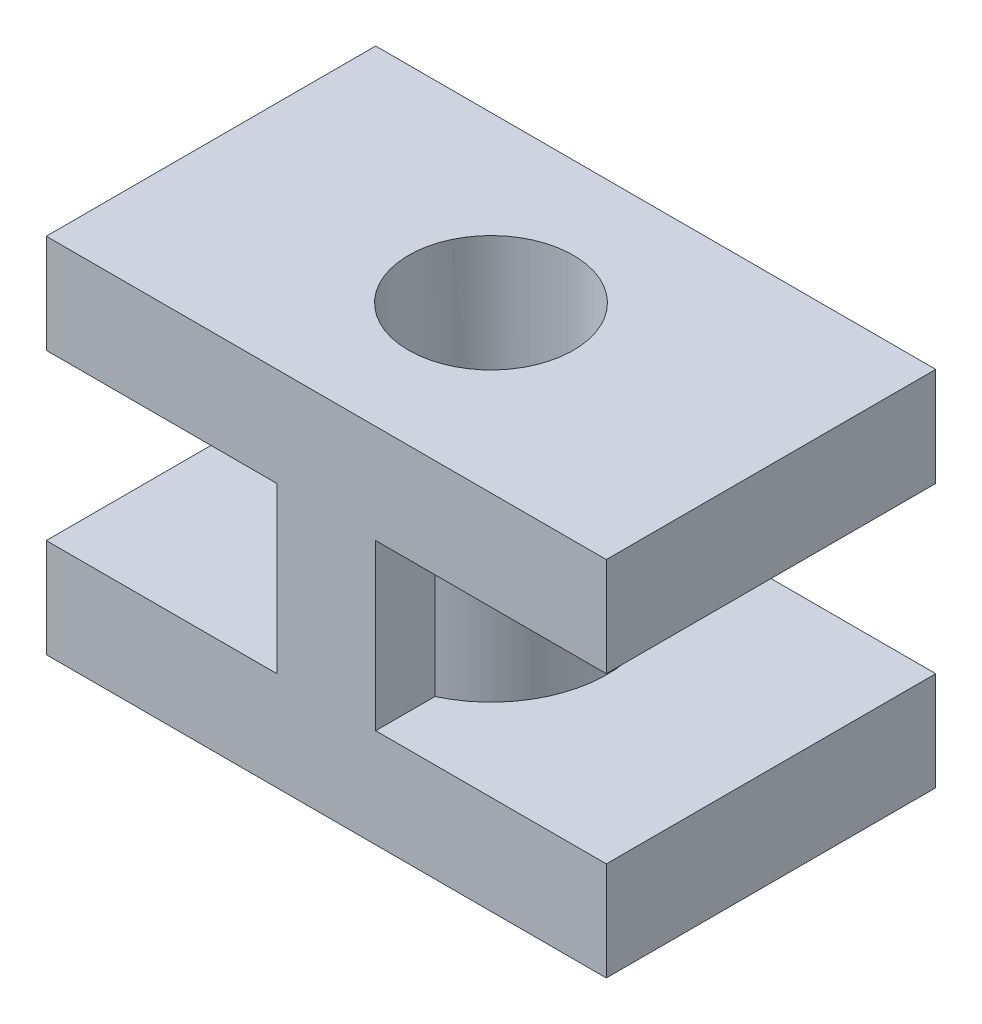
ISO-10303-21;
HEADER;
FILE_DESCRIPTION(('STEP AP214'),'2;1');
FILE_NAME('part.step','',(''),(''),'','','');
FILE_SCHEMA(('AUTOMOTIVE_DESIGN { 1 0 10303 214 1 1 1 1 }'));
ENDSEC;
DATA;
#1=APPLICATION_CONTEXT('core data for automotive mechanical design processes');
#2=APPLICATION_PROTOCOL_DEFINITION('international standard','automotive_design',2000,#1);
#3=PRODUCT_CONTEXT('',#1,'mechanical');
#4=PRODUCT('Part','Part','',(#3));
#5=PRODUCT_RELATED_PRODUCT_CATEGORY('part','',(#4));
#6=PRODUCT_DEFINITION_FORMATION('','',#4);
#7=PRODUCT_DEFINITION_CONTEXT('part definition',#1,'design');
#8=PRODUCT_DEFINITION('design','',#6,#7);
#9=PRODUCT_DEFINITION_SHAPE('','',#8);
#10=(LENGTH_UNIT() NAMED_UNIT(*) SI_UNIT(.MILLI.,.METRE.));
#11=(NAMED_UNIT(*) PLANE_ANGLE_UNIT() SI_UNIT($,.RADIAN.));
#12=(NAMED_UNIT(*) SI_UNIT($,.STERADIAN.) SOLID_ANGLE_UNIT());
#13=UNCERTAINTY_MEASURE_WITH_UNIT(LENGTH_MEASURE(1.E-05),#10,'distance_accuracy_value','');
#14=(GEOMETRIC_REPRESENTATION_CONTEXT(3) GLOBAL_UNCERTAINTY_ASSIGNED_CONTEXT((#13)) GLOBAL_UNIT_ASSIGNED_CONTEXT((#10,
#11,#12)) REPRESENTATION_CONTEXT('',''));
#15=CARTESIAN_POINT('',(0.,0.,0.));
#16=DIRECTION('',(0.,0.,1.));
#17=DIRECTION('',(1.,0.,0.));
#18=AXIS2_PLACEMENT_3D('',#15,#16,#17);
#19=CARTESIAN_POINT('',(4.25,1.5,2.5));
#20=DIRECTION('',(-1.,0.,0.));
#21=DIRECTION('',(0.,0.,1.));
#22=AXIS2_PLACEMENT_3D('',#19,#20,#21);
#23=PLANE('',#22);
#24=DIRECTION('',(0.,0.,-1.));
#25=VECTOR('',#24,1.);
#26=CARTESIAN_POINT('',(4.25,0.,2.5));
#27=LINE('',#26,#25);
#28=CARTESIAN_POINT('',(4.25,0.,2.5));
#29=VERTEX_POINT('',#28);
#30=CARTESIAN_POINT('',(4.25,0.,-2.5));
#31=VERTEX_POINT('',#30);
#32=EDGE_CURVE('E196',#29,#31,#27,.T.);
#33=ORIENTED_EDGE('',*,*,#32,.T.);
#34=DIRECTION('',(0.,-1.,0.));
#35=VECTOR('',#34,1.);
#36=CARTESIAN_POINT('',(4.25,1.5,-2.5));
#37=LINE('',#36,#35);
#38=CARTESIAN_POINT('',(4.25,1.5,-2.5));
#39=VERTEX_POINT('',#38);
#40=EDGE_CURVE('E11',#39,#31,#37,.T.);
#41=ORIENTED_EDGE('',*,*,#40,.F.);
#42=DIRECTION('',(0.,0.,-1.));
#43=VECTOR('',#42,1.);
#44=CARTESIAN_POINT('',(4.25,1.5,2.5));
#45=LINE('',#44,#43);
#46=CARTESIAN_POINT('',(4.25,1.5,2.5));
#47=VERTEX_POINT('',#46);
#48=EDGE_CURVE('E197',#47,#39,#45,.T.);
#49=ORIENTED_EDGE('',*,*,#48,.F.);
#50=DIRECTION('',(0.,-1.,0.));
#51=VECTOR('',#50,1.);
#52=CARTESIAN_POINT('',(4.25,1.5,2.5));
#53=LINE('',#52,#51);
#54=EDGE_CURVE('E212',#47,#29,#53,.T.);
#55=ORIENTED_EDGE('',*,*,#54,.T.);
#56=EDGE_LOOP('',(#33,#41,#49,#55));
#57=FACE_BOUND('',#56,.T.);
#58=ADVANCED_FACE('F39',(#57),#23,.F.);
#59=CARTESIAN_POINT('',(-4.25,1.5,-2.5));
#60=DIRECTION('',(0.,0.,1.));
#61=DIRECTION('',(1.,0.,0.));
#62=AXIS2_PLACEMENT_3D('',#59,#60,#61);
#63=PLANE('',#62);
#64=DIRECTION('',(-1.,0.,0.));
#65=VECTOR('',#64,1.);
#66=CARTESIAN_POINT('',(-4.25,0.,-2.5));
#67=LINE('',#66,#65);
#68=CARTESIAN_POINT('',(-4.25,0.,-2.5));
#69=VERTEX_POINT('',#68);
#70=EDGE_CURVE('E216',#31,#69,#67,.T.);
#71=ORIENTED_EDGE('',*,*,#70,.T.);
#72=DIRECTION('',(0.,-1.,0.));
#73=VECTOR('',#72,1.);
#74=CARTESIAN_POINT('',(-4.25,1.5,-2.5));
#75=LINE('',#74,#73);
#76=CARTESIAN_POINT('',(-4.25,1.5,-2.5));
#77=VERTEX_POINT('',#76);
#78=EDGE_CURVE('E47',#77,#69,#75,.T.);
#79=ORIENTED_EDGE('',*,*,#78,.F.);
#80=DIRECTION('',(-1.,0.,0.));
#81=VECTOR('',#80,1.);
#82=CARTESIAN_POINT('',(-4.25,1.5,-2.5));
#83=LINE('',#82,#81);
#84=EDGE_CURVE('E201',#39,#77,#83,.T.);
#85=ORIENTED_EDGE('',*,*,#84,.F.);
#86=ORIENTED_EDGE('',*,*,#40,.T.);
#87=EDGE_LOOP('',(#71,#79,#85,#86));
#88=FACE_BOUND('',#87,.T.);
#89=ADVANCED_FACE('F292',(#88),#63,.F.);
#90=CARTESIAN_POINT('',(-4.25,1.5,2.5));
#91=DIRECTION('',(1.,0.,0.));
#92=DIRECTION('',(0.,0.,-1.));
#93=AXIS2_PLACEMENT_3D('',#90,#91,#92);
#94=PLANE('',#93);
#95=DIRECTION('',(0.,0.,1.));
#96=VECTOR('',#95,1.);
#97=CARTESIAN_POINT('',(-4.25,0.,2.5));
#98=LINE('',#97,#96);
#99=CARTESIAN_POINT('',(-4.25,0.,2.5));
#100=VERTEX_POINT('',#99);
#101=EDGE_CURVE('E219',#69,#100,#98,.T.);
#102=ORIENTED_EDGE('',*,*,#101,.T.);
#103=DIRECTION('',(0.,-1.,0.));
#104=VECTOR('',#103,1.);
#105=CARTESIAN_POINT('',(-4.25,1.5,2.5));
#106=LINE('',#105,#104);
#107=CARTESIAN_POINT('',(-4.25,1.5,2.5));
#108=VERTEX_POINT('',#107);
#109=EDGE_CURVE('E227',#108,#100,#106,.T.);
#110=ORIENTED_EDGE('',*,*,#109,.F.);
#111=DIRECTION('',(0.,0.,1.));
#112=VECTOR('',#111,1.);
#113=CARTESIAN_POINT('',(-4.25,1.5,2.5));
#114=LINE('',#113,#112);
#115=EDGE_CURVE('E205',#77,#108,#114,.T.);
#116=ORIENTED_EDGE('',*,*,#115,.F.);
#117=ORIENTED_EDGE('',*,*,#78,.T.);
#118=EDGE_LOOP('',(#102,#110,#116,#117));
#119=FACE_BOUND('',#118,.T.);
#120=ADVANCED_FACE('F236',(#119),#94,.F.);
#121=CARTESIAN_POINT('',(-4.25,1.5,2.5));
#122=DIRECTION('',(0.,0.,-1.));
#123=DIRECTION('',(-1.,0.,0.));
#124=AXIS2_PLACEMENT_3D('',#121,#122,#123);
#125=PLANE('',#124);
#126=DIRECTION('',(1.,0.,0.));
#127=VECTOR('',#126,1.);
#128=CARTESIAN_POINT('',(-4.25,0.,2.5));
#129=LINE('',#128,#127);
#130=EDGE_CURVE('E202',#100,#29,#129,.T.);
#131=ORIENTED_EDGE('',*,*,#130,.T.);
#132=ORIENTED_EDGE('',*,*,#54,.F.);
#133=DIRECTION('',(1.,0.,0.));
#134=VECTOR('',#133,1.);
#135=CARTESIAN_POINT('',(-4.25,1.5,2.5));
#136=LINE('',#135,#134);
#137=CARTESIAN_POINT('',(0.75,1.5,2.5));
#138=VERTEX_POINT('',#137);
#139=EDGE_CURVE('E208',#138,#47,#136,.T.);
#140=ORIENTED_EDGE('',*,*,#139,.F.);
#141=DIRECTION('',(0.,-1.,0.));
#142=VECTOR('',#141,1.);
#143=CARTESIAN_POINT('',(0.75,4.,2.5));
#144=LINE('',#143,#142);
#145=CARTESIAN_POINT('',(0.75,4.,2.5));
#146=VERTEX_POINT('',#145);
#147=EDGE_CURVE('E175',#146,#138,#144,.T.);
#148=ORIENTED_EDGE('',*,*,#147,.F.);
#149=DIRECTION('',(1.,0.,0.));
#150=VECTOR('',#149,1.);
#151=CARTESIAN_POINT('',(-4.25,4.,2.5));
#152=LINE('',#151,#150);
#153=CARTESIAN_POINT('',(4.25,4.,2.5));
#154=VERTEX_POINT('',#153);
#155=EDGE_CURVE('E258',#146,#154,#152,.T.);
#156=ORIENTED_EDGE('',*,*,#155,.T.);
#157=DIRECTION('',(0.,-1.,0.));
#158=VECTOR('',#157,1.);
#159=CARTESIAN_POINT('',(4.25,5.5,2.5));
#160=LINE('',#159,#158);
#161=CARTESIAN_POINT('',(4.25,5.5,2.5));
#162=VERTEX_POINT('',#161);
#163=EDGE_CURVE('E270',#162,#154,#160,.T.);
#164=ORIENTED_EDGE('',*,*,#163,.F.);
#165=DIRECTION('',(1.,0.,0.));
#166=VECTOR('',#165,1.);
#167=CARTESIAN_POINT('',(-4.25,5.5,2.5));
#168=LINE('',#167,#166);
#169=CARTESIAN_POINT('',(-4.25,5.5,2.5));
#170=VERTEX_POINT('',#169);
#171=EDGE_CURVE('E144',#170,#162,#168,.T.);
#172=ORIENTED_EDGE('',*,*,#171,.F.);
#173=DIRECTION('',(0.,-1.,0.));
#174=VECTOR('',#173,1.);
#175=CARTESIAN_POINT('',(-4.25,5.5,2.5));
#176=LINE('',#175,#174);
#177=CARTESIAN_POINT('',(-4.25,4.,2.5));
#178=VERTEX_POINT('',#177);
#179=EDGE_CURVE('E159',#170,#178,#176,.T.);
#180=ORIENTED_EDGE('',*,*,#179,.T.);
#181=CARTESIAN_POINT('',(-0.75,4.,2.5));
#182=VERTEX_POINT('',#181);
#183=EDGE_CURVE('E149',#178,#182,#152,.T.);
#184=ORIENTED_EDGE('',*,*,#183,.T.);
#185=DIRECTION('',(0.,-1.,0.));
#186=VECTOR('',#185,1.);
#187=CARTESIAN_POINT('',(-0.75,4.,2.5));
#188=LINE('',#187,#186);
#189=CARTESIAN_POINT('',(-0.75,1.5,2.5));
#190=VERTEX_POINT('',#189);
#191=EDGE_CURVE('E185',#182,#190,#188,.T.);
#192=ORIENTED_EDGE('',*,*,#191,.T.);
#193=EDGE_CURVE('E209',#108,#190,#136,.T.);
#194=ORIENTED_EDGE('',*,*,#193,.F.);
#195=ORIENTED_EDGE('',*,*,#109,.T.);
#196=EDGE_LOOP('',(#131,#132,#140,#148,#156,#164,#172,#180,#184,#192,#194,#195));
#197=FACE_BOUND('',#196,.T.);
#198=ADVANCED_FACE('F245',(#197),#125,.F.);
#199=CARTESIAN_POINT('',(0.,1.5,0.));
#200=DIRECTION('',(0.,-1.,0.));
#201=DIRECTION('',(0.,0.,-1.));
#202=AXIS2_PLACEMENT_3D('',#199,#200,#201);
#203=PLANE('',#202);
#204=DIRECTION('',(0.,0.,-1.));
#205=VECTOR('',#204,1.);
#206=CARTESIAN_POINT('',(0.75,1.5,2.5));
#207=LINE('',#206,#205);
#208=CARTESIAN_POINT('',(0.749999999999999,1.5,1.60078105608241));
#209=VERTEX_POINT('',#208);
#210=EDGE_CURVE('E59',#138,#209,#207,.T.);
#211=ORIENTED_EDGE('',*,*,#210,.F.);
#212=ORIENTED_EDGE('',*,*,#139,.T.);
#213=ORIENTED_EDGE('',*,*,#48,.T.);
#214=ORIENTED_EDGE('',*,*,#84,.T.);
#215=ORIENTED_EDGE('',*,*,#115,.T.);
#216=ORIENTED_EDGE('',*,*,#193,.T.);
#217=DIRECTION('',(0.,0.,1.));
#218=VECTOR('',#217,1.);
#219=CARTESIAN_POINT('',(-0.75,1.5,2.5));
#220=LINE('',#219,#218);
#221=CARTESIAN_POINT('',(-0.75,1.5,1.60078105608241));
#222=VERTEX_POINT('',#221);
#223=EDGE_CURVE('E168',#222,#190,#220,.T.);
#224=ORIENTED_EDGE('',*,*,#223,.F.);
#225=CARTESIAN_POINT('',(0.,1.5,0.));
#226=DIRECTION('',(0.,1.,0.));
#227=DIRECTION('',(0.,0.,-1.));
#228=AXIS2_PLACEMENT_3D('',#225,#226,#227);
#229=CIRCLE('',#228,1.76776695);
#230=EDGE_CURVE('E54',#209,#222,#229,.T.);
#231=ORIENTED_EDGE('',*,*,#230,.F.);
#232=EDGE_LOOP('',(#211,#212,#213,#214,#215,#216,#224,#231));
#233=FACE_BOUND('',#232,.T.);
#234=ADVANCED_FACE('F250',(#233),#203,.F.);
#235=CARTESIAN_POINT('',(0.,0.,0.));
#236=DIRECTION('',(0.,-1.,0.));
#237=DIRECTION('',(0.,0.,-1.));
#238=AXIS2_PLACEMENT_3D('',#235,#236,#237);
#239=PLANE('',#238);
#240=CARTESIAN_POINT('',(0.,0.,0.));
#241=DIRECTION('',(0.,-1.,0.));
#242=DIRECTION('',(0.,0.,-1.));
#243=AXIS2_PLACEMENT_3D('',#240,#241,#242);
#244=CIRCLE('',#243,1.25);
#245=CARTESIAN_POINT('',(0.,0.,-1.25));
#246=VERTEX_POINT('',#245);
#247=EDGE_CURVE('E394',#246,#246,#244,.T.);
#248=ORIENTED_EDGE('',*,*,#247,.F.);
#249=EDGE_LOOP('',(#248));
#250=FACE_BOUND('',#249,.T.);
#251=ORIENTED_EDGE('',*,*,#32,.F.);
#252=ORIENTED_EDGE('',*,*,#130,.F.);
#253=ORIENTED_EDGE('',*,*,#101,.F.);
#254=ORIENTED_EDGE('',*,*,#70,.F.);
#255=EDGE_LOOP('',(#251,#252,#253,#254));
#256=FACE_BOUND('',#255,.T.);
#257=ADVANCED_FACE('F242',(#250,#256),#239,.T.);
#258=CARTESIAN_POINT('',(0.75,4.,2.5));
#259=DIRECTION('',(-1.,0.,0.));
#260=DIRECTION('',(0.,0.,1.));
#261=AXIS2_PLACEMENT_3D('',#258,#259,#260);
#262=PLANE('',#261);
#263=ORIENTED_EDGE('',*,*,#210,.T.);
#264=DIRECTION('',(0.,-1.,0.));
#265=VECTOR('',#264,1.);
#266=CARTESIAN_POINT('',(0.749999999999999,4.,1.60078105608241));
#267=LINE('',#266,#265);
#268=CARTESIAN_POINT('',(0.749999999999999,4.,1.60078105608241));
#269=VERTEX_POINT('',#268);
#270=EDGE_CURVE('E193',#269,#209,#267,.T.);
#271=ORIENTED_EDGE('',*,*,#270,.F.);
#272=DIRECTION('',(0.,0.,-1.));
#273=VECTOR('',#272,1.);
#274=CARTESIAN_POINT('',(0.75,4.,2.5));
#275=LINE('',#274,#273);
#276=EDGE_CURVE('E163',#146,#269,#275,.T.);
#277=ORIENTED_EDGE('',*,*,#276,.F.);
#278=ORIENTED_EDGE('',*,*,#147,.T.);
#279=EDGE_LOOP('',(#263,#271,#277,#278));
#280=FACE_BOUND('',#279,.T.);
#281=ADVANCED_FACE('F254',(#280),#262,.F.);
#282=CARTESIAN_POINT('',(0.,4.,0.));
#283=DIRECTION('',(0.,-1.,0.));
#284=DIRECTION('',(0.,0.,-1.));
#285=AXIS2_PLACEMENT_3D('',#282,#283,#284);
#286=CYLINDRICAL_SURFACE('',#285,1.76776695);
#287=ORIENTED_EDGE('',*,*,#230,.T.);
#288=DIRECTION('',(0.,-1.,0.));
#289=VECTOR('',#288,1.);
#290=CARTESIAN_POINT('',(-0.75,4.,1.60078105608241));
#291=LINE('',#290,#289);
#292=CARTESIAN_POINT('',(-0.75,4.,1.60078105608241));
#293=VERTEX_POINT('',#292);
#294=EDGE_CURVE('E189',#293,#222,#291,.T.);
#295=ORIENTED_EDGE('',*,*,#294,.F.);
#296=CARTESIAN_POINT('',(0.,4.,0.));
#297=DIRECTION('',(0.,1.,0.));
#298=DIRECTION('',(0.,0.,-1.));
#299=AXIS2_PLACEMENT_3D('',#296,#297,#298);
#300=CIRCLE('',#299,1.76776695);
#301=EDGE_CURVE('E167',#269,#293,#300,.T.);
#302=ORIENTED_EDGE('',*,*,#301,.F.);
#303=ORIENTED_EDGE('',*,*,#270,.T.);
#304=EDGE_LOOP('',(#287,#295,#302,#303));
#305=FACE_BOUND('',#304,.T.);
#306=ADVANCED_FACE('F282',(#305),#286,.T.);
#307=CARTESIAN_POINT('',(-0.75,4.,2.5));
#308=DIRECTION('',(1.,0.,0.));
#309=DIRECTION('',(0.,0.,-1.));
#310=AXIS2_PLACEMENT_3D('',#307,#308,#309);
#311=PLANE('',#310);
#312=ORIENTED_EDGE('',*,*,#223,.T.);
#313=ORIENTED_EDGE('',*,*,#191,.F.);
#314=DIRECTION('',(0.,0.,1.));
#315=VECTOR('',#314,1.);
#316=CARTESIAN_POINT('',(-0.75,4.,2.5));
#317=LINE('',#316,#315);
#318=EDGE_CURVE('E172',#293,#182,#317,.T.);
#319=ORIENTED_EDGE('',*,*,#318,.F.);
#320=ORIENTED_EDGE('',*,*,#294,.T.);
#321=EDGE_LOOP('',(#312,#313,#319,#320));
#322=FACE_BOUND('',#321,.T.);
#323=ADVANCED_FACE('F280',(#322),#311,.F.);
#324=CARTESIAN_POINT('',(4.25,5.5,2.5));
#325=DIRECTION('',(-1.,0.,0.));
#326=DIRECTION('',(0.,0.,1.));
#327=AXIS2_PLACEMENT_3D('',#324,#325,#326);
#328=PLANE('',#327);
#329=DIRECTION('',(0.,0.,-1.));
#330=VECTOR('',#329,1.);
#331=CARTESIAN_POINT('',(4.25,4.,2.5));
#332=LINE('',#331,#330);
#333=CARTESIAN_POINT('',(4.25,4.,-2.5));
#334=VERTEX_POINT('',#333);
#335=EDGE_CURVE('E153',#154,#334,#332,.T.);
#336=ORIENTED_EDGE('',*,*,#335,.T.);
#337=DIRECTION('',(0.,-1.,0.));
#338=VECTOR('',#337,1.);
#339=CARTESIAN_POINT('',(4.25,5.5,-2.5));
#340=LINE('',#339,#338);
#341=CARTESIAN_POINT('',(4.25,5.5,-2.5));
#342=VERTEX_POINT('',#341);
#343=EDGE_CURVE('E131',#342,#334,#340,.T.);
#344=ORIENTED_EDGE('',*,*,#343,.F.);
#345=DIRECTION('',(0.,0.,-1.));
#346=VECTOR('',#345,1.);
#347=CARTESIAN_POINT('',(4.25,5.5,2.5));
#348=LINE('',#347,#346);
#349=EDGE_CURVE('E139',#162,#342,#348,.T.);
#350=ORIENTED_EDGE('',*,*,#349,.F.);
#351=ORIENTED_EDGE('',*,*,#163,.T.);
#352=EDGE_LOOP('',(#336,#344,#350,#351));
#353=FACE_BOUND('',#352,.T.);
#354=ADVANCED_FACE('F151',(#353),#328,.F.);
#355=CARTESIAN_POINT('',(-4.25,5.5,-2.5));
#356=DIRECTION('',(0.,0.,1.));
#357=DIRECTION('',(1.,0.,0.));
#358=AXIS2_PLACEMENT_3D('',#355,#356,#357);
#359=PLANE('',#358);
#360=DIRECTION('',(-1.,0.,0.));
#361=VECTOR('',#360,1.);
#362=CARTESIAN_POINT('',(-4.25,4.,-2.5));
#363=LINE('',#362,#361);
#364=CARTESIAN_POINT('',(-4.25,4.,-2.5));
#365=VERTEX_POINT('',#364);
#366=EDGE_CURVE('E266',#334,#365,#363,.T.);
#367=ORIENTED_EDGE('',*,*,#366,.T.);
#368=DIRECTION('',(0.,-1.,0.));
#369=VECTOR('',#368,1.);
#370=CARTESIAN_POINT('',(-4.25,5.5,-2.5));
#371=LINE('',#370,#369);
#372=CARTESIAN_POINT('',(-4.25,5.5,-2.5));
#373=VERTEX_POINT('',#372);
#374=EDGE_CURVE('E134',#373,#365,#371,.T.);
#375=ORIENTED_EDGE('',*,*,#374,.F.);
#376=DIRECTION('',(-1.,0.,0.));
#377=VECTOR('',#376,1.);
#378=CARTESIAN_POINT('',(-4.25,5.5,-2.5));
#379=LINE('',#378,#377);
#380=EDGE_CURVE('E127',#342,#373,#379,.T.);
#381=ORIENTED_EDGE('',*,*,#380,.F.);
#382=ORIENTED_EDGE('',*,*,#343,.T.);
#383=EDGE_LOOP('',(#367,#375,#381,#382));
#384=FACE_BOUND('',#383,.T.);
#385=ADVANCED_FACE('F129',(#384),#359,.F.);
#386=CARTESIAN_POINT('',(-4.25,5.5,2.5));
#387=DIRECTION('',(1.,0.,0.));
#388=DIRECTION('',(0.,0.,-1.));
#389=AXIS2_PLACEMENT_3D('',#386,#387,#388);
#390=PLANE('',#389);
#391=DIRECTION('',(0.,0.,1.));
#392=VECTOR('',#391,1.);
#393=CARTESIAN_POINT('',(-4.25,4.,2.5));
#394=LINE('',#393,#392);
#395=EDGE_CURVE('E261',#365,#178,#394,.T.);
#396=ORIENTED_EDGE('',*,*,#395,.T.);
#397=ORIENTED_EDGE('',*,*,#179,.F.);
#398=DIRECTION('',(0.,0.,1.));
#399=VECTOR('',#398,1.);
#400=CARTESIAN_POINT('',(-4.25,5.5,2.5));
#401=LINE('',#400,#399);
#402=EDGE_CURVE('E138',#373,#170,#401,.T.);
#403=ORIENTED_EDGE('',*,*,#402,.F.);
#404=ORIENTED_EDGE('',*,*,#374,.T.);
#405=EDGE_LOOP('',(#396,#397,#403,#404));
#406=FACE_BOUND('',#405,.T.);
#407=ADVANCED_FACE('F352',(#406),#390,.F.);
#408=CARTESIAN_POINT('',(0.,5.5,0.));
#409=DIRECTION('',(0.,-1.,0.));
#410=DIRECTION('',(0.,0.,-1.));
#411=AXIS2_PLACEMENT_3D('',#408,#409,#410);
#412=PLANE('',#411);
#413=CARTESIAN_POINT('',(0.,5.5,0.));
#414=DIRECTION('',(0.,1.,0.));
#415=DIRECTION('',(0.,0.,1.));
#416=AXIS2_PLACEMENT_3D('',#413,#414,#415);
#417=CIRCLE('',#416,1.25);
#418=CARTESIAN_POINT('',(0.,5.5,1.25));
#419=VERTEX_POINT('',#418);
#420=EDGE_CURVE('E391',#419,#419,#417,.T.);
#421=ORIENTED_EDGE('',*,*,#420,.F.);
#422=EDGE_LOOP('',(#421));
#423=FACE_BOUND('',#422,.T.);
#424=ORIENTED_EDGE('',*,*,#349,.T.);
#425=ORIENTED_EDGE('',*,*,#380,.T.);
#426=ORIENTED_EDGE('',*,*,#402,.T.);
#427=ORIENTED_EDGE('',*,*,#171,.T.);
#428=EDGE_LOOP('',(#424,#425,#426,#427));
#429=FACE_BOUND('',#428,.T.);
#430=ADVANCED_FACE('F142',(#423,#429),#412,.F.);
#431=CARTESIAN_POINT('',(0.,4.,0.));
#432=DIRECTION('',(0.,-1.,0.));
#433=DIRECTION('',(0.,0.,-1.));
#434=AXIS2_PLACEMENT_3D('',#431,#432,#433);
#435=PLANE('',#434);
#436=ORIENTED_EDGE('',*,*,#155,.F.);
#437=ORIENTED_EDGE('',*,*,#276,.T.);
#438=ORIENTED_EDGE('',*,*,#301,.T.);
#439=ORIENTED_EDGE('',*,*,#318,.T.);
#440=ORIENTED_EDGE('',*,*,#183,.F.);
#441=ORIENTED_EDGE('',*,*,#395,.F.);
#442=ORIENTED_EDGE('',*,*,#366,.F.);
#443=ORIENTED_EDGE('',*,*,#335,.F.);
#444=EDGE_LOOP('',(#436,#437,#438,#439,#440,#441,#442,#443));
#445=FACE_BOUND('',#444,.T.);
#446=ADVANCED_FACE('F259',(#445),#435,.T.);
#447=CARTESIAN_POINT('',(0.,-6.,0.));
#448=DIRECTION('',(0.,1.,0.));
#449=DIRECTION('',(0.,0.,1.));
#450=AXIS2_PLACEMENT_3D('',#447,#448,#449);
#451=CYLINDRICAL_SURFACE('',#450,1.25);
#452=ORIENTED_EDGE('',*,*,#247,.T.);
#453=EDGE_LOOP('',(#452));
#454=FACE_BOUND('',#453,.T.);
#455=ORIENTED_EDGE('',*,*,#420,.T.);
#456=EDGE_LOOP('',(#455));
#457=FACE_BOUND('',#456,.T.);
#458=ADVANCED_FACE('F369',(#454,#457),#451,.F.);
#459=CLOSED_SHELL('',(#58,#89,#120,#198,#234,#257,#281,#306,#323,#354,#385,#407,#430,#446,#458));
#460=MANIFOLD_SOLID_BREP('B2',#459);
#461=ADVANCED_BREP_SHAPE_REPRESENTATION('',(#18,#460),#14);
#462=SHAPE_DEFINITION_REPRESENTATION(#9,#461);
ENDSEC;
END-ISO-10303-21;
